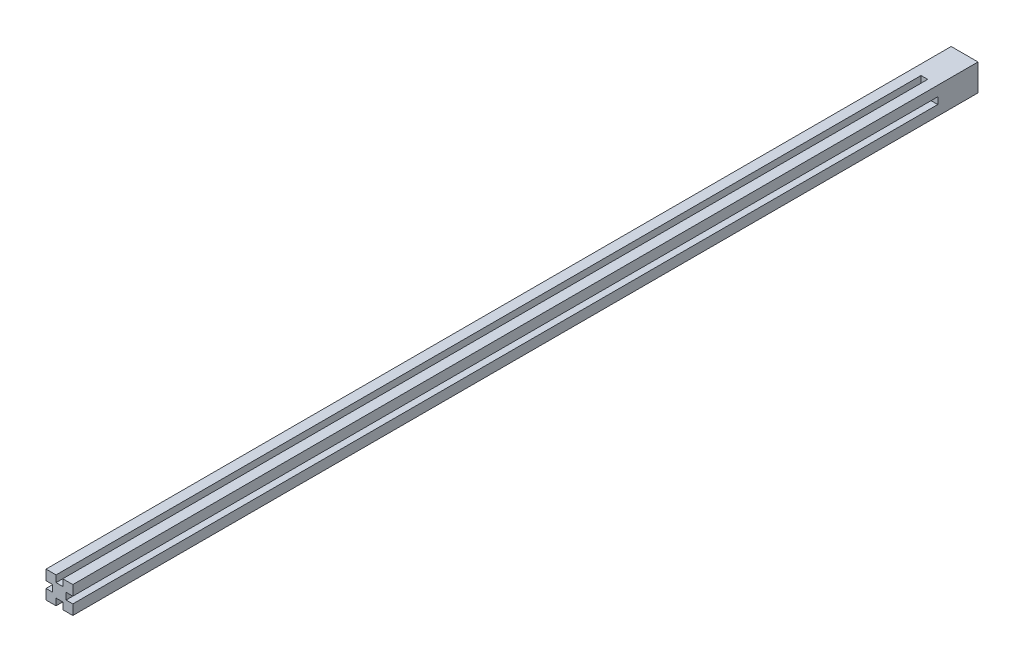
ISO-10303-21;
HEADER;
FILE_DESCRIPTION(('STEP AP214'),'2;1');
FILE_NAME('part.step','',(''),(''),'','','');
FILE_SCHEMA(('AUTOMOTIVE_DESIGN { 1 0 10303 214 1 1 1 1 }'));
ENDSEC;
DATA;
#1=APPLICATION_CONTEXT('core data for automotive mechanical design processes');
#2=APPLICATION_PROTOCOL_DEFINITION('international standard','automotive_design',2000,#1);
#3=PRODUCT_CONTEXT('',#1,'mechanical');
#4=PRODUCT('Part','Part','',(#3));
#5=PRODUCT_RELATED_PRODUCT_CATEGORY('part','',(#4));
#6=PRODUCT_DEFINITION_FORMATION('','',#4);
#7=PRODUCT_DEFINITION_CONTEXT('part definition',#1,'design');
#8=PRODUCT_DEFINITION('design','',#6,#7);
#9=PRODUCT_DEFINITION_SHAPE('','',#8);
#10=(LENGTH_UNIT() NAMED_UNIT(*) SI_UNIT(.MILLI.,.METRE.));
#11=(NAMED_UNIT(*) PLANE_ANGLE_UNIT() SI_UNIT($,.RADIAN.));
#12=(NAMED_UNIT(*) SI_UNIT($,.STERADIAN.) SOLID_ANGLE_UNIT());
#13=UNCERTAINTY_MEASURE_WITH_UNIT(LENGTH_MEASURE(1.E-05),#10,'distance_accuracy_value','');
#14=(GEOMETRIC_REPRESENTATION_CONTEXT(3) GLOBAL_UNCERTAINTY_ASSIGNED_CONTEXT((#13)) GLOBAL_UNIT_ASSIGNED_CONTEXT((#10,
#11,#12)) REPRESENTATION_CONTEXT('',''));
#15=CARTESIAN_POINT('',(0.,0.,0.));
#16=DIRECTION('',(0.,0.,1.));
#17=DIRECTION('',(1.,0.,0.));
#18=AXIS2_PLACEMENT_3D('',#15,#16,#17);
#19=CARTESIAN_POINT('',(0.,0.,0.));
#20=DIRECTION('',(0.,0.,1.));
#21=DIRECTION('',(1.,0.,0.));
#22=AXIS2_PLACEMENT_3D('',#19,#20,#21);
#23=PLANE('',#22);
#24=DIRECTION('',(0.,-1.,0.));
#25=VECTOR('',#24,1.);
#26=CARTESIAN_POINT('',(10.,0.,0.));
#27=LINE('',#26,#25);
#28=CARTESIAN_POINT('',(10.,-2.50000000000004,0.));
#29=VERTEX_POINT('',#28);
#30=CARTESIAN_POINT('',(10.,-10.,0.));
#31=VERTEX_POINT('',#30);
#32=EDGE_CURVE('E281',#29,#31,#27,.T.);
#33=ORIENTED_EDGE('',*,*,#32,.F.);
#34=DIRECTION('',(-1.,0.,0.));
#35=VECTOR('',#34,1.);
#36=CARTESIAN_POINT('',(15.,-2.50000000000005,0.));
#37=LINE('',#36,#35);
#38=CARTESIAN_POINT('',(4.99999999999999,-2.50000000000002,0.));
#39=VERTEX_POINT('',#38);
#40=EDGE_CURVE('E194',#29,#39,#37,.T.);
#41=ORIENTED_EDGE('',*,*,#40,.T.);
#42=DIRECTION('',(0.,-1.,0.));
#43=VECTOR('',#42,1.);
#44=CARTESIAN_POINT('',(5.00000000000001,2.49999999999998,0.));
#45=LINE('',#44,#43);
#46=CARTESIAN_POINT('',(5.00000000000001,2.49999999999998,0.));
#47=VERTEX_POINT('',#46);
#48=EDGE_CURVE('E182',#47,#39,#45,.T.);
#49=ORIENTED_EDGE('',*,*,#48,.F.);
#50=DIRECTION('',(-1.,0.,0.));
#51=VECTOR('',#50,1.);
#52=CARTESIAN_POINT('',(15.,2.49999999999995,0.));
#53=LINE('',#52,#51);
#54=CARTESIAN_POINT('',(10.,2.49999999999996,0.));
#55=VERTEX_POINT('',#54);
#56=EDGE_CURVE('E175',#55,#47,#53,.T.);
#57=ORIENTED_EDGE('',*,*,#56,.F.);
#58=CARTESIAN_POINT('',(10.,10.,0.));
#59=VERTEX_POINT('',#58);
#60=EDGE_CURVE('E261',#59,#55,#27,.T.);
#61=ORIENTED_EDGE('',*,*,#60,.F.);
#62=DIRECTION('',(1.,0.,0.));
#63=VECTOR('',#62,1.);
#64=CARTESIAN_POINT('',(0.,10.,0.));
#65=LINE('',#64,#63);
#66=CARTESIAN_POINT('',(2.5,10.,0.));
#67=VERTEX_POINT('',#66);
#68=EDGE_CURVE('E256',#67,#59,#65,.T.);
#69=ORIENTED_EDGE('',*,*,#68,.F.);
#70=DIRECTION('',(0.,-1.,0.));
#71=VECTOR('',#70,1.);
#72=CARTESIAN_POINT('',(2.5,0.,0.));
#73=LINE('',#72,#71);
#74=CARTESIAN_POINT('',(2.5,5.,0.));
#75=VERTEX_POINT('',#74);
#76=EDGE_CURVE('E296',#67,#75,#73,.T.);
#77=ORIENTED_EDGE('',*,*,#76,.T.);
#78=DIRECTION('',(1.,0.,0.));
#79=VECTOR('',#78,1.);
#80=CARTESIAN_POINT('',(-2.5,5.,0.));
#81=LINE('',#80,#79);
#82=CARTESIAN_POINT('',(-2.5,5.,0.));
#83=VERTEX_POINT('',#82);
#84=EDGE_CURVE('E184',#83,#75,#81,.T.);
#85=ORIENTED_EDGE('',*,*,#84,.F.);
#86=DIRECTION('',(0.,-1.,0.));
#87=VECTOR('',#86,1.);
#88=CARTESIAN_POINT('',(-2.5,0.,0.));
#89=LINE('',#88,#87);
#90=CARTESIAN_POINT('',(-2.5,10.,0.));
#91=VERTEX_POINT('',#90);
#92=EDGE_CURVE('E287',#91,#83,#89,.T.);
#93=ORIENTED_EDGE('',*,*,#92,.F.);
#94=CARTESIAN_POINT('',(-10.,10.,0.));
#95=VERTEX_POINT('',#94);
#96=EDGE_CURVE('E270',#95,#91,#65,.T.);
#97=ORIENTED_EDGE('',*,*,#96,.F.);
#98=DIRECTION('',(0.,-1.,0.));
#99=VECTOR('',#98,1.);
#100=CARTESIAN_POINT('',(-10.,0.,0.));
#101=LINE('',#100,#99);
#102=CARTESIAN_POINT('',(-10.,2.50000000000011,0.));
#103=VERTEX_POINT('',#102);
#104=EDGE_CURVE('E274',#95,#103,#101,.T.);
#105=ORIENTED_EDGE('',*,*,#104,.T.);
#106=DIRECTION('',(1.,0.,0.));
#107=VECTOR('',#106,1.);
#108=CARTESIAN_POINT('',(-15.,2.50000000000016,0.));
#109=LINE('',#108,#107);
#110=CARTESIAN_POINT('',(-4.99999999999997,2.50000000000005,0.));
#111=VERTEX_POINT('',#110);
#112=EDGE_CURVE('E227',#103,#111,#109,.T.);
#113=ORIENTED_EDGE('',*,*,#112,.T.);
#114=DIRECTION('',(0.,1.,0.));
#115=VECTOR('',#114,1.);
#116=CARTESIAN_POINT('',(-5.00000000000002,-2.49999999999995,0.));
#117=LINE('',#116,#115);
#118=CARTESIAN_POINT('',(-5.00000000000002,-2.49999999999995,0.));
#119=VERTEX_POINT('',#118);
#120=EDGE_CURVE('E230',#119,#111,#117,.T.);
#121=ORIENTED_EDGE('',*,*,#120,.F.);
#122=DIRECTION('',(1.,0.,0.));
#123=VECTOR('',#122,1.);
#124=CARTESIAN_POINT('',(-15.,-2.49999999999984,0.));
#125=LINE('',#124,#123);
#126=CARTESIAN_POINT('',(-10.,-2.49999999999989,0.));
#127=VERTEX_POINT('',#126);
#128=EDGE_CURVE('E221',#127,#119,#125,.T.);
#129=ORIENTED_EDGE('',*,*,#128,.F.);
#130=CARTESIAN_POINT('',(-10.,-10.,0.));
#131=VERTEX_POINT('',#130);
#132=EDGE_CURVE('E273',#127,#131,#101,.T.);
#133=ORIENTED_EDGE('',*,*,#132,.T.);
#134=DIRECTION('',(1.,0.,0.));
#135=VECTOR('',#134,1.);
#136=CARTESIAN_POINT('',(0.,-10.,0.));
#137=LINE('',#136,#135);
#138=CARTESIAN_POINT('',(-2.5,-10.,0.));
#139=VERTEX_POINT('',#138);
#140=EDGE_CURVE('E278',#131,#139,#137,.T.);
#141=ORIENTED_EDGE('',*,*,#140,.T.);
#142=DIRECTION('',(0.,1.,0.));
#143=VECTOR('',#142,1.);
#144=CARTESIAN_POINT('',(-2.5,-15.,0.));
#145=LINE('',#144,#143);
#146=CARTESIAN_POINT('',(-2.5,-5.,0.));
#147=VERTEX_POINT('',#146);
#148=EDGE_CURVE('E207',#139,#147,#145,.T.);
#149=ORIENTED_EDGE('',*,*,#148,.T.);
#150=DIRECTION('',(-1.,0.,0.));
#151=VECTOR('',#150,1.);
#152=CARTESIAN_POINT('',(2.5,-5.,0.));
#153=LINE('',#152,#151);
#154=CARTESIAN_POINT('',(2.5,-5.,0.));
#155=VERTEX_POINT('',#154);
#156=EDGE_CURVE('E210',#155,#147,#153,.T.);
#157=ORIENTED_EDGE('',*,*,#156,.F.);
#158=DIRECTION('',(0.,1.,0.));
#159=VECTOR('',#158,1.);
#160=CARTESIAN_POINT('',(2.5,-15.,0.));
#161=LINE('',#160,#159);
#162=CARTESIAN_POINT('',(2.5,-10.,0.));
#163=VERTEX_POINT('',#162);
#164=EDGE_CURVE('E202',#163,#155,#161,.T.);
#165=ORIENTED_EDGE('',*,*,#164,.F.);
#166=EDGE_CURVE('E277',#163,#31,#137,.T.);
#167=ORIENTED_EDGE('',*,*,#166,.T.);
#168=EDGE_LOOP('',(#33,#41,#49,#57,#61,#69,#77,#85,#93,#97,#105,#113,#121,#129,#133,#141,#149,
#157,#165,#167));
#169=FACE_BOUND('',#168,.T.);
#170=ADVANCED_FACE('F34',(#169),#23,.T.);
#171=CARTESIAN_POINT('',(10.,0.,-675.));
#172=DIRECTION('',(-1.,0.,0.));
#173=DIRECTION('',(0.,0.,1.));
#174=AXIS2_PLACEMENT_3D('',#171,#172,#173);
#175=PLANE('',#174);
#176=DIRECTION('',(0.,0.,-1.));
#177=VECTOR('',#176,1.);
#178=CARTESIAN_POINT('',(10.,-2.50000000000004,-675.));
#179=LINE('',#178,#177);
#180=CARTESIAN_POINT('',(10.,-2.50000000000005,-645.));
#181=VERTEX_POINT('',#180);
#182=EDGE_CURVE('E11',#29,#181,#179,.T.);
#183=ORIENTED_EDGE('',*,*,#182,.F.);
#184=ORIENTED_EDGE('',*,*,#32,.T.);
#185=DIRECTION('',(0.,0.,1.));
#186=VECTOR('',#185,1.);
#187=CARTESIAN_POINT('',(10.,-10.,-675.));
#188=LINE('',#187,#186);
#189=CARTESIAN_POINT('',(10.,-10.,-675.));
#190=VERTEX_POINT('',#189);
#191=EDGE_CURVE('E288',#190,#31,#188,.T.);
#192=ORIENTED_EDGE('',*,*,#191,.F.);
#193=DIRECTION('',(0.,-1.,0.));
#194=VECTOR('',#193,1.);
#195=CARTESIAN_POINT('',(10.,0.,-675.));
#196=LINE('',#195,#194);
#197=CARTESIAN_POINT('',(10.,10.,-675.));
#198=VERTEX_POINT('',#197);
#199=EDGE_CURVE('E267',#198,#190,#196,.T.);
#200=ORIENTED_EDGE('',*,*,#199,.F.);
#201=DIRECTION('',(0.,0.,1.));
#202=VECTOR('',#201,1.);
#203=CARTESIAN_POINT('',(10.,10.,-675.));
#204=LINE('',#203,#202);
#205=EDGE_CURVE('E284',#198,#59,#204,.T.);
#206=ORIENTED_EDGE('',*,*,#205,.T.);
#207=ORIENTED_EDGE('',*,*,#60,.T.);
#208=DIRECTION('',(0.,0.,-1.));
#209=VECTOR('',#208,1.);
#210=CARTESIAN_POINT('',(10.,2.49999999999996,-675.));
#211=LINE('',#210,#209);
#212=CARTESIAN_POINT('',(10.,2.49999999999996,-645.));
#213=VERTEX_POINT('',#212);
#214=EDGE_CURVE('E42',#55,#213,#211,.T.);
#215=ORIENTED_EDGE('',*,*,#214,.T.);
#216=DIRECTION('',(0.,-1.,0.));
#217=VECTOR('',#216,1.);
#218=CARTESIAN_POINT('',(10.,0.,-645.));
#219=LINE('',#218,#217);
#220=EDGE_CURVE('E316',#213,#181,#219,.T.);
#221=ORIENTED_EDGE('',*,*,#220,.T.);
#222=EDGE_LOOP('',(#183,#184,#192,#200,#206,#207,#215,#221));
#223=FACE_BOUND('',#222,.T.);
#224=ADVANCED_FACE('F319',(#223),#175,.F.);
#225=CARTESIAN_POINT('',(0.,-10.,-675.));
#226=DIRECTION('',(0.,-1.,0.));
#227=DIRECTION('',(0.,0.,-1.));
#228=AXIS2_PLACEMENT_3D('',#225,#226,#227);
#229=PLANE('',#228);
#230=DIRECTION('',(1.,0.,0.));
#231=VECTOR('',#230,1.);
#232=CARTESIAN_POINT('',(0.,-10.,-645.));
#233=LINE('',#232,#231);
#234=CARTESIAN_POINT('',(-2.5,-10.,-645.));
#235=VERTEX_POINT('',#234);
#236=CARTESIAN_POINT('',(2.5,-10.,-645.));
#237=VERTEX_POINT('',#236);
#238=EDGE_CURVE('E309',#235,#237,#233,.T.);
#239=ORIENTED_EDGE('',*,*,#238,.F.);
#240=DIRECTION('',(0.,0.,1.));
#241=VECTOR('',#240,1.);
#242=CARTESIAN_POINT('',(-2.5,-10.,-675.));
#243=LINE('',#242,#241);
#244=EDGE_CURVE('E313',#235,#139,#243,.T.);
#245=ORIENTED_EDGE('',*,*,#244,.T.);
#246=ORIENTED_EDGE('',*,*,#140,.F.);
#247=DIRECTION('',(0.,0.,1.));
#248=VECTOR('',#247,1.);
#249=CARTESIAN_POINT('',(-10.,-10.,-675.));
#250=LINE('',#249,#248);
#251=CARTESIAN_POINT('',(-10.,-10.,-675.));
#252=VERTEX_POINT('',#251);
#253=EDGE_CURVE('E291',#252,#131,#250,.T.);
#254=ORIENTED_EDGE('',*,*,#253,.F.);
#255=DIRECTION('',(1.,0.,0.));
#256=VECTOR('',#255,1.);
#257=CARTESIAN_POINT('',(0.,-10.,-675.));
#258=LINE('',#257,#256);
#259=EDGE_CURVE('E264',#252,#190,#258,.T.);
#260=ORIENTED_EDGE('',*,*,#259,.T.);
#261=ORIENTED_EDGE('',*,*,#191,.T.);
#262=ORIENTED_EDGE('',*,*,#166,.F.);
#263=DIRECTION('',(0.,0.,1.));
#264=VECTOR('',#263,1.);
#265=CARTESIAN_POINT('',(2.5,-10.,-675.));
#266=LINE('',#265,#264);
#267=EDGE_CURVE('E311',#237,#163,#266,.T.);
#268=ORIENTED_EDGE('',*,*,#267,.F.);
#269=EDGE_LOOP('',(#239,#245,#246,#254,#260,#261,#262,#268));
#270=FACE_BOUND('',#269,.T.);
#271=ADVANCED_FACE('F335',(#270),#229,.T.);
#272=CARTESIAN_POINT('',(-10.,0.,-675.));
#273=DIRECTION('',(-1.,0.,0.));
#274=DIRECTION('',(0.,-1.,0.));
#275=AXIS2_PLACEMENT_3D('',#272,#273,#274);
#276=PLANE('',#275);
#277=DIRECTION('',(0.,-1.,0.));
#278=VECTOR('',#277,1.);
#279=CARTESIAN_POINT('',(-10.,0.,-645.));
#280=LINE('',#279,#278);
#281=CARTESIAN_POINT('',(-10.,2.50000000000016,-645.));
#282=VERTEX_POINT('',#281);
#283=CARTESIAN_POINT('',(-10.,-2.49999999999989,-645.));
#284=VERTEX_POINT('',#283);
#285=EDGE_CURVE('E302',#282,#284,#280,.T.);
#286=ORIENTED_EDGE('',*,*,#285,.F.);
#287=DIRECTION('',(0.,0.,1.));
#288=VECTOR('',#287,1.);
#289=CARTESIAN_POINT('',(-10.,2.50000000000011,-675.));
#290=LINE('',#289,#288);
#291=EDGE_CURVE('E306',#282,#103,#290,.T.);
#292=ORIENTED_EDGE('',*,*,#291,.T.);
#293=ORIENTED_EDGE('',*,*,#104,.F.);
#294=DIRECTION('',(0.,0.,1.));
#295=VECTOR('',#294,1.);
#296=CARTESIAN_POINT('',(-10.,10.,-675.));
#297=LINE('',#296,#295);
#298=CARTESIAN_POINT('',(-10.,10.,-675.));
#299=VERTEX_POINT('',#298);
#300=EDGE_CURVE('E269',#299,#95,#297,.T.);
#301=ORIENTED_EDGE('',*,*,#300,.F.);
#302=DIRECTION('',(0.,-1.,0.));
#303=VECTOR('',#302,1.);
#304=CARTESIAN_POINT('',(-10.,0.,-675.));
#305=LINE('',#304,#303);
#306=EDGE_CURVE('E260',#299,#252,#305,.T.);
#307=ORIENTED_EDGE('',*,*,#306,.T.);
#308=ORIENTED_EDGE('',*,*,#253,.T.);
#309=ORIENTED_EDGE('',*,*,#132,.F.);
#310=DIRECTION('',(0.,0.,1.));
#311=VECTOR('',#310,1.);
#312=CARTESIAN_POINT('',(-10.,-2.49999999999989,-675.));
#313=LINE('',#312,#311);
#314=EDGE_CURVE('E304',#284,#127,#313,.T.);
#315=ORIENTED_EDGE('',*,*,#314,.F.);
#316=EDGE_LOOP('',(#286,#292,#293,#301,#307,#308,#309,#315));
#317=FACE_BOUND('',#316,.T.);
#318=ADVANCED_FACE('F343',(#317),#276,.T.);
#319=CARTESIAN_POINT('',(0.,10.,-675.));
#320=DIRECTION('',(0.,-1.,0.));
#321=DIRECTION('',(0.,0.,-1.));
#322=AXIS2_PLACEMENT_3D('',#319,#320,#321);
#323=PLANE('',#322);
#324=DIRECTION('',(0.,0.,-1.));
#325=VECTOR('',#324,1.);
#326=CARTESIAN_POINT('',(2.5,10.,-675.));
#327=LINE('',#326,#325);
#328=CARTESIAN_POINT('',(2.5,10.,-645.));
#329=VERTEX_POINT('',#328);
#330=EDGE_CURVE('E254',#67,#329,#327,.T.);
#331=ORIENTED_EDGE('',*,*,#330,.F.);
#332=ORIENTED_EDGE('',*,*,#68,.T.);
#333=ORIENTED_EDGE('',*,*,#205,.F.);
#334=DIRECTION('',(1.,0.,0.));
#335=VECTOR('',#334,1.);
#336=CARTESIAN_POINT('',(0.,10.,-675.));
#337=LINE('',#336,#335);
#338=EDGE_CURVE('E257',#299,#198,#337,.T.);
#339=ORIENTED_EDGE('',*,*,#338,.F.);
#340=ORIENTED_EDGE('',*,*,#300,.T.);
#341=ORIENTED_EDGE('',*,*,#96,.T.);
#342=DIRECTION('',(0.,0.,-1.));
#343=VECTOR('',#342,1.);
#344=CARTESIAN_POINT('',(-2.5,10.,-675.));
#345=LINE('',#344,#343);
#346=CARTESIAN_POINT('',(-2.5,10.,-645.));
#347=VERTEX_POINT('',#346);
#348=EDGE_CURVE('E251',#91,#347,#345,.T.);
#349=ORIENTED_EDGE('',*,*,#348,.T.);
#350=DIRECTION('',(1.,0.,0.));
#351=VECTOR('',#350,1.);
#352=CARTESIAN_POINT('',(0.,10.,-645.));
#353=LINE('',#352,#351);
#354=EDGE_CURVE('E299',#347,#329,#353,.T.);
#355=ORIENTED_EDGE('',*,*,#354,.T.);
#356=EDGE_LOOP('',(#331,#332,#333,#339,#340,#341,#349,#355));
#357=FACE_BOUND('',#356,.T.);
#358=ADVANCED_FACE('F36',(#357),#323,.F.);
#359=CARTESIAN_POINT('',(0.,0.,-675.));
#360=DIRECTION('',(0.,0.,1.));
#361=DIRECTION('',(1.,0.,0.));
#362=AXIS2_PLACEMENT_3D('',#359,#360,#361);
#363=PLANE('',#362);
#364=ORIENTED_EDGE('',*,*,#338,.T.);
#365=ORIENTED_EDGE('',*,*,#199,.T.);
#366=ORIENTED_EDGE('',*,*,#259,.F.);
#367=ORIENTED_EDGE('',*,*,#306,.F.);
#368=EDGE_LOOP('',(#364,#365,#366,#367));
#369=FACE_BOUND('',#368,.T.);
#370=ADVANCED_FACE('F340',(#369),#363,.F.);
#371=CARTESIAN_POINT('',(0.,0.,-645.));
#372=DIRECTION('',(0.,0.,-1.));
#373=DIRECTION('',(-1.,0.,0.));
#374=AXIS2_PLACEMENT_3D('',#371,#372,#373);
#375=PLANE('',#374);
#376=DIRECTION('',(0.,-1.,0.));
#377=VECTOR('',#376,1.);
#378=CARTESIAN_POINT('',(-2.5,15.,-645.));
#379=LINE('',#378,#377);
#380=CARTESIAN_POINT('',(-2.5,5.,-645.));
#381=VERTEX_POINT('',#380);
#382=EDGE_CURVE('E242',#347,#381,#379,.T.);
#383=ORIENTED_EDGE('',*,*,#382,.T.);
#384=DIRECTION('',(1.,0.,0.));
#385=VECTOR('',#384,1.);
#386=CARTESIAN_POINT('',(-2.5,5.,-645.));
#387=LINE('',#386,#385);
#388=CARTESIAN_POINT('',(2.5,5.,-645.));
#389=VERTEX_POINT('',#388);
#390=EDGE_CURVE('E239',#381,#389,#387,.T.);
#391=ORIENTED_EDGE('',*,*,#390,.T.);
#392=DIRECTION('',(0.,-1.,0.));
#393=VECTOR('',#392,1.);
#394=CARTESIAN_POINT('',(2.5,15.,-645.));
#395=LINE('',#394,#393);
#396=EDGE_CURVE('E237',#329,#389,#395,.T.);
#397=ORIENTED_EDGE('',*,*,#396,.F.);
#398=ORIENTED_EDGE('',*,*,#354,.F.);
#399=EDGE_LOOP('',(#383,#391,#397,#398));
#400=FACE_BOUND('',#399,.T.);
#401=ADVANCED_FACE('F365',(#400),#375,.F.);
#402=CARTESIAN_POINT('',(2.5,15.,-645.));
#403=DIRECTION('',(-1.,0.,0.));
#404=DIRECTION('',(0.,-1.,0.));
#405=AXIS2_PLACEMENT_3D('',#402,#403,#404);
#406=PLANE('',#405);
#407=ORIENTED_EDGE('',*,*,#330,.T.);
#408=ORIENTED_EDGE('',*,*,#396,.T.);
#409=DIRECTION('',(0.,0.,1.));
#410=VECTOR('',#409,1.);
#411=CARTESIAN_POINT('',(2.5,5.,-645.));
#412=LINE('',#411,#410);
#413=EDGE_CURVE('E249',#389,#75,#412,.T.);
#414=ORIENTED_EDGE('',*,*,#413,.T.);
#415=ORIENTED_EDGE('',*,*,#76,.F.);
#416=EDGE_LOOP('',(#407,#408,#414,#415));
#417=FACE_BOUND('',#416,.T.);
#418=ADVANCED_FACE('F354',(#417),#406,.T.);
#419=CARTESIAN_POINT('',(-2.5,15.,-645.));
#420=DIRECTION('',(-1.,0.,0.));
#421=DIRECTION('',(0.,-1.,0.));
#422=AXIS2_PLACEMENT_3D('',#419,#420,#421);
#423=PLANE('',#422);
#424=ORIENTED_EDGE('',*,*,#92,.T.);
#425=DIRECTION('',(0.,0.,1.));
#426=VECTOR('',#425,1.);
#427=CARTESIAN_POINT('',(-2.5,5.,-645.));
#428=LINE('',#427,#426);
#429=EDGE_CURVE('E244',#381,#83,#428,.T.);
#430=ORIENTED_EDGE('',*,*,#429,.F.);
#431=ORIENTED_EDGE('',*,*,#382,.F.);
#432=ORIENTED_EDGE('',*,*,#348,.F.);
#433=EDGE_LOOP('',(#424,#430,#431,#432));
#434=FACE_BOUND('',#433,.T.);
#435=ADVANCED_FACE('F363',(#434),#423,.F.);
#436=CARTESIAN_POINT('',(-2.5,5.,-645.));
#437=DIRECTION('',(0.,-1.,0.));
#438=DIRECTION('',(0.,0.,-1.));
#439=AXIS2_PLACEMENT_3D('',#436,#437,#438);
#440=PLANE('',#439);
#441=ORIENTED_EDGE('',*,*,#84,.T.);
#442=ORIENTED_EDGE('',*,*,#413,.F.);
#443=ORIENTED_EDGE('',*,*,#390,.F.);
#444=ORIENTED_EDGE('',*,*,#429,.T.);
#445=EDGE_LOOP('',(#441,#442,#443,#444));
#446=FACE_BOUND('',#445,.T.);
#447=ADVANCED_FACE('F359',(#446),#440,.F.);
#448=CARTESIAN_POINT('',(-15.,2.50000000000016,-645.));
#449=DIRECTION('',(0.,-1.,0.));
#450=DIRECTION('',(1.,0.,0.));
#451=AXIS2_PLACEMENT_3D('',#448,#449,#450);
#452=PLANE('',#451);
#453=DIRECTION('',(1.,0.,0.));
#454=VECTOR('',#453,1.);
#455=CARTESIAN_POINT('',(-15.,2.50000000000016,-645.));
#456=LINE('',#455,#454);
#457=CARTESIAN_POINT('',(-4.99999999999997,2.50000000000005,-645.));
#458=VERTEX_POINT('',#457);
#459=EDGE_CURVE('E218',#282,#458,#456,.T.);
#460=ORIENTED_EDGE('',*,*,#459,.T.);
#461=DIRECTION('',(0.,0.,1.));
#462=VECTOR('',#461,1.);
#463=CARTESIAN_POINT('',(-4.99999999999997,2.50000000000005,-645.));
#464=LINE('',#463,#462);
#465=EDGE_CURVE('E211',#458,#111,#464,.T.);
#466=ORIENTED_EDGE('',*,*,#465,.T.);
#467=ORIENTED_EDGE('',*,*,#112,.F.);
#468=ORIENTED_EDGE('',*,*,#291,.F.);
#469=EDGE_LOOP('',(#460,#466,#467,#468));
#470=FACE_BOUND('',#469,.T.);
#471=ADVANCED_FACE('F424',(#470),#452,.T.);
#472=CARTESIAN_POINT('',(-5.00000000000002,-2.49999999999995,-645.));
#473=DIRECTION('',(1.,0.,0.));
#474=DIRECTION('',(0.,1.,0.));
#475=AXIS2_PLACEMENT_3D('',#472,#473,#474);
#476=PLANE('',#475);
#477=ORIENTED_EDGE('',*,*,#120,.T.);
#478=ORIENTED_EDGE('',*,*,#465,.F.);
#479=DIRECTION('',(0.,1.,0.));
#480=VECTOR('',#479,1.);
#481=CARTESIAN_POINT('',(-5.00000000000002,-2.49999999999995,-645.));
#482=LINE('',#481,#480);
#483=CARTESIAN_POINT('',(-5.00000000000002,-2.49999999999995,-645.));
#484=VERTEX_POINT('',#483);
#485=EDGE_CURVE('E220',#484,#458,#482,.T.);
#486=ORIENTED_EDGE('',*,*,#485,.F.);
#487=DIRECTION('',(0.,0.,1.));
#488=VECTOR('',#487,1.);
#489=CARTESIAN_POINT('',(-5.00000000000002,-2.49999999999995,-645.));
#490=LINE('',#489,#488);
#491=EDGE_CURVE('E226',#484,#119,#490,.T.);
#492=ORIENTED_EDGE('',*,*,#491,.T.);
#493=EDGE_LOOP('',(#477,#478,#486,#492));
#494=FACE_BOUND('',#493,.T.);
#495=ADVANCED_FACE('F453',(#494),#476,.F.);
#496=CARTESIAN_POINT('',(-15.,-2.49999999999984,-645.));
#497=DIRECTION('',(0.,-1.,0.));
#498=DIRECTION('',(1.,0.,0.));
#499=AXIS2_PLACEMENT_3D('',#496,#497,#498);
#500=PLANE('',#499);
#501=ORIENTED_EDGE('',*,*,#314,.T.);
#502=ORIENTED_EDGE('',*,*,#128,.T.);
#503=ORIENTED_EDGE('',*,*,#491,.F.);
#504=DIRECTION('',(1.,0.,0.));
#505=VECTOR('',#504,1.);
#506=CARTESIAN_POINT('',(-15.,-2.49999999999984,-645.));
#507=LINE('',#506,#505);
#508=EDGE_CURVE('E224',#284,#484,#507,.T.);
#509=ORIENTED_EDGE('',*,*,#508,.F.);
#510=EDGE_LOOP('',(#501,#502,#503,#509));
#511=FACE_BOUND('',#510,.T.);
#512=ADVANCED_FACE('F461',(#511),#500,.F.);
#513=CARTESIAN_POINT('',(0.,0.,-645.));
#514=DIRECTION('',(0.,0.,-1.));
#515=DIRECTION('',(0.,-1.,0.));
#516=AXIS2_PLACEMENT_3D('',#513,#514,#515);
#517=PLANE('',#516);
#518=ORIENTED_EDGE('',*,*,#285,.T.);
#519=ORIENTED_EDGE('',*,*,#508,.T.);
#520=ORIENTED_EDGE('',*,*,#485,.T.);
#521=ORIENTED_EDGE('',*,*,#459,.F.);
#522=EDGE_LOOP('',(#518,#519,#520,#521));
#523=FACE_BOUND('',#522,.T.);
#524=ADVANCED_FACE('F470',(#523),#517,.F.);
#525=CARTESIAN_POINT('',(-2.5,-15.,-645.));
#526=DIRECTION('',(1.,0.,0.));
#527=DIRECTION('',(0.,1.,0.));
#528=AXIS2_PLACEMENT_3D('',#525,#526,#527);
#529=PLANE('',#528);
#530=DIRECTION('',(0.,1.,0.));
#531=VECTOR('',#530,1.);
#532=CARTESIAN_POINT('',(-2.5,-15.,-645.));
#533=LINE('',#532,#531);
#534=CARTESIAN_POINT('',(-2.5,-5.,-645.));
#535=VERTEX_POINT('',#534);
#536=EDGE_CURVE('E56',#235,#535,#533,.T.);
#537=ORIENTED_EDGE('',*,*,#536,.T.);
#538=DIRECTION('',(0.,0.,1.));
#539=VECTOR('',#538,1.);
#540=CARTESIAN_POINT('',(-2.5,-5.,-645.));
#541=LINE('',#540,#539);
#542=EDGE_CURVE('E196',#535,#147,#541,.T.);
#543=ORIENTED_EDGE('',*,*,#542,.T.);
#544=ORIENTED_EDGE('',*,*,#148,.F.);
#545=ORIENTED_EDGE('',*,*,#244,.F.);
#546=EDGE_LOOP('',(#537,#543,#544,#545));
#547=FACE_BOUND('',#546,.T.);
#548=ADVANCED_FACE('F479',(#547),#529,.T.);
#549=CARTESIAN_POINT('',(2.5,-5.,-645.));
#550=DIRECTION('',(0.,1.,0.));
#551=DIRECTION('',(0.,0.,1.));
#552=AXIS2_PLACEMENT_3D('',#549,#550,#551);
#553=PLANE('',#552);
#554=ORIENTED_EDGE('',*,*,#156,.T.);
#555=ORIENTED_EDGE('',*,*,#542,.F.);
#556=DIRECTION('',(-1.,0.,0.));
#557=VECTOR('',#556,1.);
#558=CARTESIAN_POINT('',(2.5,-5.,-645.));
#559=LINE('',#558,#557);
#560=CARTESIAN_POINT('',(2.5,-5.,-645.));
#561=VERTEX_POINT('',#560);
#562=EDGE_CURVE('E201',#561,#535,#559,.T.);
#563=ORIENTED_EDGE('',*,*,#562,.F.);
#564=DIRECTION('',(0.,0.,1.));
#565=VECTOR('',#564,1.);
#566=CARTESIAN_POINT('',(2.5,-5.,-645.));
#567=LINE('',#566,#565);
#568=EDGE_CURVE('E206',#561,#155,#567,.T.);
#569=ORIENTED_EDGE('',*,*,#568,.T.);
#570=EDGE_LOOP('',(#554,#555,#563,#569));
#571=FACE_BOUND('',#570,.T.);
#572=ADVANCED_FACE('F488',(#571),#553,.F.);
#573=CARTESIAN_POINT('',(2.5,-15.,-645.));
#574=DIRECTION('',(1.,0.,0.));
#575=DIRECTION('',(0.,1.,0.));
#576=AXIS2_PLACEMENT_3D('',#573,#574,#575);
#577=PLANE('',#576);
#578=ORIENTED_EDGE('',*,*,#267,.T.);
#579=ORIENTED_EDGE('',*,*,#164,.T.);
#580=ORIENTED_EDGE('',*,*,#568,.F.);
#581=DIRECTION('',(0.,1.,0.));
#582=VECTOR('',#581,1.);
#583=CARTESIAN_POINT('',(2.5,-15.,-645.));
#584=LINE('',#583,#582);
#585=EDGE_CURVE('E204',#237,#561,#584,.T.);
#586=ORIENTED_EDGE('',*,*,#585,.F.);
#587=EDGE_LOOP('',(#578,#579,#580,#586));
#588=FACE_BOUND('',#587,.T.);
#589=ADVANCED_FACE('F497',(#588),#577,.F.);
#590=CARTESIAN_POINT('',(0.,0.,-645.));
#591=DIRECTION('',(0.,0.,-1.));
#592=DIRECTION('',(1.,0.,0.));
#593=AXIS2_PLACEMENT_3D('',#590,#591,#592);
#594=PLANE('',#593);
#595=ORIENTED_EDGE('',*,*,#238,.T.);
#596=ORIENTED_EDGE('',*,*,#585,.T.);
#597=ORIENTED_EDGE('',*,*,#562,.T.);
#598=ORIENTED_EDGE('',*,*,#536,.F.);
#599=EDGE_LOOP('',(#595,#596,#597,#598));
#600=FACE_BOUND('',#599,.T.);
#601=ADVANCED_FACE('F506',(#600),#594,.F.);
#602=CARTESIAN_POINT('',(15.,-2.50000000000005,-645.));
#603=DIRECTION('',(0.,1.,0.));
#604=DIRECTION('',(-1.,0.,0.));
#605=AXIS2_PLACEMENT_3D('',#602,#603,#604);
#606=PLANE('',#605);
#607=ORIENTED_EDGE('',*,*,#182,.T.);
#608=DIRECTION('',(-1.,0.,0.));
#609=VECTOR('',#608,1.);
#610=CARTESIAN_POINT('',(15.,-2.50000000000005,-645.));
#611=LINE('',#610,#609);
#612=CARTESIAN_POINT('',(4.99999999999999,-2.50000000000002,-645.));
#613=VERTEX_POINT('',#612);
#614=EDGE_CURVE('E49',#181,#613,#611,.T.);
#615=ORIENTED_EDGE('',*,*,#614,.T.);
#616=DIRECTION('',(0.,0.,1.));
#617=VECTOR('',#616,1.);
#618=CARTESIAN_POINT('',(4.99999999999999,-2.50000000000002,-645.));
#619=LINE('',#618,#617);
#620=EDGE_CURVE('E170',#613,#39,#619,.T.);
#621=ORIENTED_EDGE('',*,*,#620,.T.);
#622=ORIENTED_EDGE('',*,*,#40,.F.);
#623=EDGE_LOOP('',(#607,#615,#621,#622));
#624=FACE_BOUND('',#623,.T.);
#625=ADVANCED_FACE('F169',(#624),#606,.T.);
#626=CARTESIAN_POINT('',(15.,2.49999999999995,-645.));
#627=DIRECTION('',(0.,1.,0.));
#628=DIRECTION('',(-1.,0.,0.));
#629=AXIS2_PLACEMENT_3D('',#626,#627,#628);
#630=PLANE('',#629);
#631=ORIENTED_EDGE('',*,*,#56,.T.);
#632=DIRECTION('',(0.,0.,1.));
#633=VECTOR('',#632,1.);
#634=CARTESIAN_POINT('',(5.00000000000001,2.49999999999998,-645.));
#635=LINE('',#634,#633);
#636=CARTESIAN_POINT('',(5.00000000000001,2.49999999999998,-645.));
#637=VERTEX_POINT('',#636);
#638=EDGE_CURVE('E185',#637,#47,#635,.T.);
#639=ORIENTED_EDGE('',*,*,#638,.F.);
#640=DIRECTION('',(-1.,0.,0.));
#641=VECTOR('',#640,1.);
#642=CARTESIAN_POINT('',(15.,2.49999999999995,-645.));
#643=LINE('',#642,#641);
#644=EDGE_CURVE('E189',#213,#637,#643,.T.);
#645=ORIENTED_EDGE('',*,*,#644,.F.);
#646=ORIENTED_EDGE('',*,*,#214,.F.);
#647=EDGE_LOOP('',(#631,#639,#645,#646));
#648=FACE_BOUND('',#647,.T.);
#649=ADVANCED_FACE('F323',(#648),#630,.F.);
#650=CARTESIAN_POINT('',(0.,0.,-645.));
#651=DIRECTION('',(0.,0.,-1.));
#652=DIRECTION('',(0.,1.,0.));
#653=AXIS2_PLACEMENT_3D('',#650,#651,#652);
#654=PLANE('',#653);
#655=ORIENTED_EDGE('',*,*,#644,.T.);
#656=DIRECTION('',(0.,-1.,0.));
#657=VECTOR('',#656,1.);
#658=CARTESIAN_POINT('',(5.00000000000001,2.49999999999998,-645.));
#659=LINE('',#658,#657);
#660=EDGE_CURVE('E174',#637,#613,#659,.T.);
#661=ORIENTED_EDGE('',*,*,#660,.T.);
#662=ORIENTED_EDGE('',*,*,#614,.F.);
#663=ORIENTED_EDGE('',*,*,#220,.F.);
#664=EDGE_LOOP('',(#655,#661,#662,#663));
#665=FACE_BOUND('',#664,.T.);
#666=ADVANCED_FACE('F187',(#665),#654,.F.);
#667=CARTESIAN_POINT('',(5.00000000000001,2.49999999999998,-645.));
#668=DIRECTION('',(-1.,0.,0.));
#669=DIRECTION('',(0.,-1.,0.));
#670=AXIS2_PLACEMENT_3D('',#667,#668,#669);
#671=PLANE('',#670);
#672=ORIENTED_EDGE('',*,*,#48,.T.);
#673=ORIENTED_EDGE('',*,*,#620,.F.);
#674=ORIENTED_EDGE('',*,*,#660,.F.);
#675=ORIENTED_EDGE('',*,*,#638,.T.);
#676=EDGE_LOOP('',(#672,#673,#674,#675));
#677=FACE_BOUND('',#676,.T.);
#678=ADVANCED_FACE('F179',(#677),#671,.F.);
#679=CLOSED_SHELL('',(#170,#224,#271,#318,#358,#370,#401,#418,#435,#447,#471,#495,#512,#524,
#548,#572,#589,#601,#625,#649,#666,#678));
#680=MANIFOLD_SOLID_BREP('B2',#679);
#681=ADVANCED_BREP_SHAPE_REPRESENTATION('',(#18,#680),#14);
#682=SHAPE_DEFINITION_REPRESENTATION(#9,#681);
ENDSEC;
END-ISO-10303-21;
